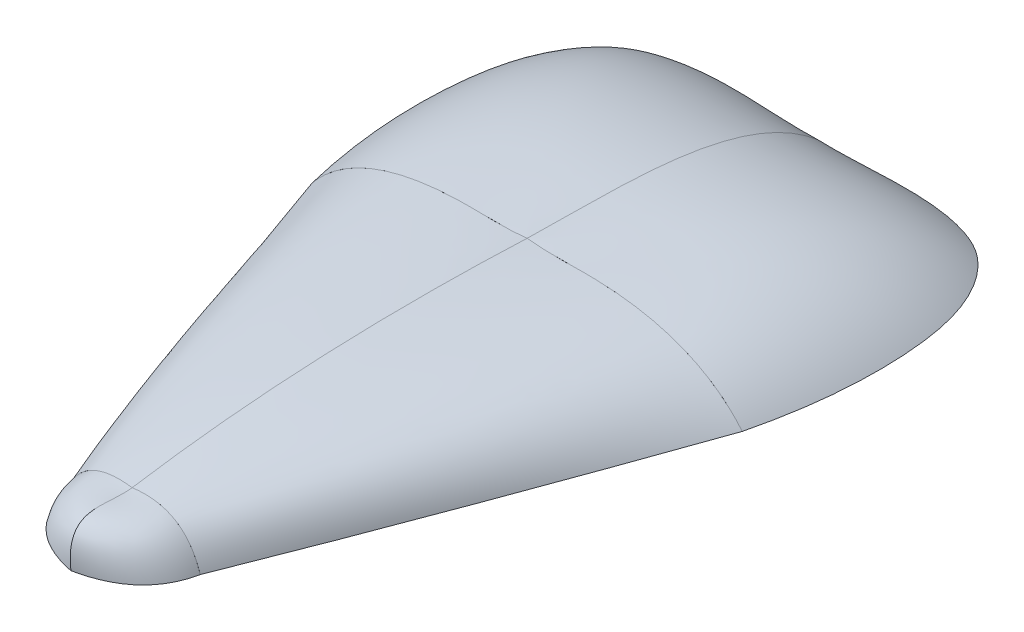
ISO-10303-21;
HEADER;
FILE_DESCRIPTION(('STEP AP214'),'2;1');
FILE_NAME('part.step','',(''),(''),'','','');
FILE_SCHEMA(('AUTOMOTIVE_DESIGN { 1 0 10303 214 1 1 1 1 }'));
ENDSEC;
DATA;
#1=APPLICATION_CONTEXT('core data for automotive mechanical design processes');
#2=APPLICATION_PROTOCOL_DEFINITION('international standard','automotive_design',2000,#1);
#3=PRODUCT_CONTEXT('',#1,'mechanical');
#4=PRODUCT('Part','Part','',(#3));
#5=PRODUCT_RELATED_PRODUCT_CATEGORY('part','',(#4));
#6=PRODUCT_DEFINITION_FORMATION('','',#4);
#7=PRODUCT_DEFINITION_CONTEXT('part definition',#1,'design');
#8=PRODUCT_DEFINITION('design','',#6,#7);
#9=PRODUCT_DEFINITION_SHAPE('','',#8);
#10=(LENGTH_UNIT() NAMED_UNIT(*) SI_UNIT(.MILLI.,.METRE.));
#11=(NAMED_UNIT(*) PLANE_ANGLE_UNIT() SI_UNIT($,.RADIAN.));
#12=(NAMED_UNIT(*) SI_UNIT($,.STERADIAN.) SOLID_ANGLE_UNIT());
#13=UNCERTAINTY_MEASURE_WITH_UNIT(LENGTH_MEASURE(1.E-05),#10,'distance_accuracy_value','');
#14=(GEOMETRIC_REPRESENTATION_CONTEXT(3) GLOBAL_UNCERTAINTY_ASSIGNED_CONTEXT((#13)) GLOBAL_UNIT_ASSIGNED_CONTEXT((#10,
#11,#12)) REPRESENTATION_CONTEXT('',''));
#15=CARTESIAN_POINT('',(0.,0.,0.));
#16=DIRECTION('',(0.,0.,1.));
#17=DIRECTION('',(1.,0.,0.));
#18=AXIS2_PLACEMENT_3D('',#15,#16,#17);
#19=CARTESIAN_POINT('',(0.,-3.048,-2.5));
#20=DIRECTION('',(0.,1.,0.));
#21=DIRECTION('',(0.,0.,1.));
#22=AXIS2_PLACEMENT_3D('',#19,#20,#21);
#23=CYLINDRICAL_SURFACE('',#22,1.50309515720072);
#24=CARTESIAN_POINT('',(0.,-3.048,-2.5));
#25=DIRECTION('',(0.,1.,0.));
#26=DIRECTION('',(0.,0.,1.));
#27=AXIS2_PLACEMENT_3D('',#24,#25,#26);
#28=CIRCLE('',#27,1.50309515720072);
#29=CARTESIAN_POINT('',(0.,-3.048,-0.996904842799275));
#30=VERTEX_POINT('',#29);
#31=EDGE_CURVE('E13',#30,#30,#28,.T.);
#32=ORIENTED_EDGE('',*,*,#31,.T.);
#33=EDGE_LOOP('',(#32));
#34=FACE_BOUND('',#33,.T.);
#35=CARTESIAN_POINT('',(0.,0.253999999999999,-2.5));
#36=DIRECTION('',(0.,1.,0.));
#37=DIRECTION('',(0.,0.,1.));
#38=AXIS2_PLACEMENT_3D('',#35,#36,#37);
#39=CIRCLE('',#38,1.50309515720072);
#40=CARTESIAN_POINT('',(0.,0.253999999999999,-0.996904842799275));
#41=VERTEX_POINT('',#40);
#42=EDGE_CURVE('E93',#41,#41,#39,.T.);
#43=ORIENTED_EDGE('',*,*,#42,.F.);
#44=EDGE_LOOP('',(#43));
#45=FACE_BOUND('',#44,.T.);
#46=ADVANCED_FACE('F87',(#34,#45),#23,.T.);
#47=CARTESIAN_POINT('',(0.,-3.048,-2.5));
#48=DIRECTION('',(0.,1.,0.));
#49=DIRECTION('',(0.,0.,1.));
#50=AXIS2_PLACEMENT_3D('',#47,#48,#49);
#51=PLANE('',#50);
#52=ORIENTED_EDGE('',*,*,#31,.F.);
#53=EDGE_LOOP('',(#52));
#54=FACE_BOUND('',#53,.T.);
#55=ADVANCED_FACE('F102',(#54),#51,.F.);
#56=CARTESIAN_POINT('',(0.,0.253999999999999,-2.5));
#57=DIRECTION('',(0.,1.,0.));
#58=DIRECTION('',(0.,0.,1.));
#59=AXIS2_PLACEMENT_3D('',#56,#57,#58);
#60=PLANE('',#59);
#61=ORIENTED_EDGE('',*,*,#42,.T.);
#62=EDGE_LOOP('',(#61));
#63=FACE_BOUND('',#62,.T.);
#64=ADVANCED_FACE('F99',(#63),#60,.T.);
#65=CLOSED_SHELL('',(#46,#55,#64));
#66=MANIFOLD_SOLID_BREP('B2',#65);
#67=CARTESIAN_POINT('',(-2.5,0.,11.999999954));
#68=CARTESIAN_POINT('',(-2.2485749813273,0.,13.2125933350633));
#69=CARTESIAN_POINT('',(-1.41524164799396,0.,13.9629908761228));
#70=CARTESIAN_POINT('',(0.,0.,14.2511925771786));
#71=CARTESIAN_POINT('',(-2.40547884853265,0.295573915839917,11.999999954));
#72=CARTESIAN_POINT('',(-2.13706852079401,0.372812403053674,13.1924822990457));
#73=CARTESIAN_POINT('',(-1.3352422379498,0.450050890267431,13.961285124088));
#74=CARTESIAN_POINT('',(0.,0.527289377481187,14.306408429127));
#75=CARTESIAN_POINT('',(-2.15953045466497,0.802032900927076,11.999999954));
#76=CARTESIAN_POINT('',(-1.87611820577212,0.943482467398371,13.0805249824838));
#77=CARTESIAN_POINT('',(-1.1562747208838,1.08493203386967,13.8144031309648));
#78=CARTESIAN_POINT('',(0.,1.22638160034096,14.2016343994431));
#79=CARTESIAN_POINT('',(-1.61988959106445,1.30765483877979,11.999999954));
#80=CARTESIAN_POINT('',(-1.37088055137328,1.39082830464443,12.7677318602908));
#81=CARTESIAN_POINT('',(-0.8309173543518,1.47400177050907,13.3043658465798));
#82=CARTESIAN_POINT('',(0.,1.55717523637372,13.609901912867));
#83=CARTESIAN_POINT('',(-0.909530454664967,1.55921023685447,11.999999954));
#84=CARTESIAN_POINT('',(-0.751830715108469,1.54571984863648,12.3804301769782));
#85=CARTESIAN_POINT('',(-0.448653896886813,1.53222946041848,12.6453114399556));
#86=CARTESIAN_POINT('',(0.,1.51873907220048,12.794643742932));
#87=CARTESIAN_POINT('',(-0.322145515199319,1.55753614238557,11.999999954));
#88=CARTESIAN_POINT('',(-0.263256036354599,1.53148132647314,12.1194557381771));
#89=CARTESIAN_POINT('',(-0.155874197954826,1.5054265105607,12.2003952023538));
#90=CARTESIAN_POINT('',(0.,1.47937169464826,12.2428183465302));
#91=CARTESIAN_POINT('',(0.,1.51435467185479,11.999999954));
#92=CARTESIAN_POINT('',(0.,1.51435467185479,11.999999954));
#93=CARTESIAN_POINT('',(0.,1.51435467185479,11.999999954));
#94=CARTESIAN_POINT('',(0.,1.51435467185479,11.999999954));
#95=B_SPLINE_SURFACE_WITH_KNOTS('',3,3,((#67,#68,#69,#70),(#71,#72,#73,#74),(#75,#76,#77,#78),
(#79,#80,#81,#82),(#83,#84,#85,#86),(#87,#88,#89,#90),(#91,#92,#93,#94)),.UNSPECIFIED.,.F.,.F.,
.F.,(4,1,1,1,4),(4,4),(0.,0.25,0.5,0.75,1.),(0.,1.),.UNSPECIFIED.);
#96=CARTESIAN_POINT('',(-2.5,0.,11.999999954));
#97=CARTESIAN_POINT('',(-2.40547884853265,0.295573915839917,11.999999954));
#98=CARTESIAN_POINT('',(-2.15953045466497,0.802032900927076,11.999999954));
#99=CARTESIAN_POINT('',(-1.61988959106445,1.30765483877979,11.999999954));
#100=CARTESIAN_POINT('',(-0.909530454664967,1.55921023685447,11.999999954));
#101=CARTESIAN_POINT('',(-0.322145515199319,1.55753614238557,11.999999954));
#102=CARTESIAN_POINT('',(0.,1.51435467185479,11.999999954));
#103=B_SPLINE_CURVE_WITH_KNOTS('',3,(#96,#97,#98,#99,#100,#101,#102),.UNSPECIFIED.,.F.,.F.,(4,1,
1,1,4),(0.,0.25,0.5,0.75,1.),.UNSPECIFIED.);
#104=CARTESIAN_POINT('',(-2.5,0.,11.999999954));
#105=VERTEX_POINT('',#104);
#106=CARTESIAN_POINT('',(0.,1.51435467185479,11.999999954));
#107=VERTEX_POINT('',#106);
#108=EDGE_CURVE('E85',#105,#107,#103,.T.);
#109=CARTESIAN_POINT('',(-2.5,0.,11.999999954));
#110=CARTESIAN_POINT('',(-2.2485749813273,0.,13.2125933350633));
#111=CARTESIAN_POINT('',(-1.41524164799396,0.,13.9629908761228));
#112=CARTESIAN_POINT('',(0.,0.,14.2511925771786));
#113=B_SPLINE_CURVE_WITH_KNOTS('',3,(#109,#110,#111,#112),.UNSPECIFIED.,.F.,.F.,(4,4),(0.,1.),.UNSPECIFIED.);
#114=CARTESIAN_POINT('',(0.,0.,14.2511925771786));
#115=VERTEX_POINT('',#114);
#116=EDGE_CURVE('E140',#115,#105,#113,.F.);
#117=CARTESIAN_POINT('',(0.,0.,14.2511925771786));
#118=CARTESIAN_POINT('',(0.,0.527289377481187,14.306408429127));
#119=CARTESIAN_POINT('',(0.,1.22638160034096,14.2016343994431));
#120=CARTESIAN_POINT('',(0.,1.55717523637372,13.609901912867));
#121=CARTESIAN_POINT('',(0.,1.51873907220048,12.794643742932));
#122=CARTESIAN_POINT('',(0.,1.47937169464826,12.2428183465302));
#123=CARTESIAN_POINT('',(0.,1.51435467185479,11.999999954));
#124=B_SPLINE_CURVE_WITH_KNOTS('',3,(#117,#118,#119,#120,#121,#122,#123),.UNSPECIFIED.,.F.,.F.,
(4,1,1,1,4),(0.,0.25,0.5,0.75,1.),.UNSPECIFIED.);
#125=EDGE_CURVE('E147',#107,#115,#124,.F.);
#126=ORIENTED_EDGE('',*,*,#108,.F.);
#127=ORIENTED_EDGE('',*,*,#116,.F.);
#128=ORIENTED_EDGE('',*,*,#125,.F.);
#129=EDGE_LOOP('',(#126,#127,#128));
#130=FACE_BOUND('',#129,.T.);
#131=ADVANCED_FACE('F137',(#130),#95,.F.);
#132=OPEN_SHELL('',(#131));
#133=SHELL_BASED_SURFACE_MODEL('B8',(#132));
#134=CARTESIAN_POINT('',(-7.89646434519079,0.,-2.5));
#135=CARTESIAN_POINT('',(-8.34056381802185,0.,-4.3145718992722));
#136=CARTESIAN_POINT('',(-8.67675271254389,0.,-7.22662606235981));
#137=CARTESIAN_POINT('',(-8.04620599111287,0.,-10.7905165297115));
#138=CARTESIAN_POINT('',(-6.68608144682956,0.,-12.5381744419552));
#139=CARTESIAN_POINT('',(-3.9824740090126,0.,-13.5236682374836));
#140=CARTESIAN_POINT('',(-1.72189430537076,0.,-13.0985066910037));
#141=CARTESIAN_POINT('',(0.,0.,-13.1616084390565));
#142=CARTESIAN_POINT('',(-7.43335469209301,0.562300337042816,-2.5));
#143=CARTESIAN_POINT('',(-7.81930023009668,0.56717082817761,-4.18245510758736));
#144=CARTESIAN_POINT('',(-8.09443307157859,0.574781026051725,-6.88167820365306));
#145=CARTESIAN_POINT('',(-7.47639444109343,0.584002884015909,-10.1847373428587));
#146=CARTESIAN_POINT('',(-6.20567008023899,0.58951781351622,-11.8083815164927));
#147=CARTESIAN_POINT('',(-3.69542722662514,0.59687366268603,-12.7405936234004));
#148=CARTESIAN_POINT('',(-1.59829028668191,0.602617851765771,-12.3733855692359));
#149=CARTESIAN_POINT('',(0.,0.607198478174591,-12.4491897918613));
#150=CARTESIAN_POINT('',(-6.31019405332889,1.41496266989754,-2.5));
#151=CARTESIAN_POINT('',(-6.60119565769317,1.42168322706584,-3.89633573615478));
#152=CARTESIAN_POINT('',(-6.78759778645896,1.43218417418997,-6.13569990504435));
#153=CARTESIAN_POINT('',(-6.2350261215827,1.44490897379045,-8.87565752206856));
#154=CARTESIAN_POINT('',(-5.16729282986084,1.45251876055737,-10.2264926153789));
#155=CARTESIAN_POINT('',(-3.07604486214526,1.4626687441009,-11.0190874801478));
#156=CARTESIAN_POINT('',(-1.33098977673827,1.47059487516808,-10.7419746184739));
#157=CARTESIAN_POINT('',(0.,1.47691546190053,-10.8226005233819));
#158=CARTESIAN_POINT('',(-4.60159741079324,1.94243165659006,-2.5));
#159=CARTESIAN_POINT('',(-4.80696667748336,1.94332346827715,-3.50710396689867));
#160=CARTESIAN_POINT('',(-4.93409263454699,1.94471693419616,-5.12229637495215));
#161=CARTESIAN_POINT('',(-4.5259274387756,1.94640550327093,-7.09857822544378));
#162=CARTESIAN_POINT('',(-3.74935324877032,1.9474153148989,-8.0726405719618));
#163=CARTESIAN_POINT('',(-2.23176028392809,1.94876220827711,-8.64301509880276));
#164=CARTESIAN_POINT('',(-0.965783369291165,1.94981399849957,-8.44127320442748));
#165=CARTESIAN_POINT('',(0.,1.95065273448174,-8.49822327642134));
#166=CARTESIAN_POINT('',(-3.17543750348962,2.12287676141758,-2.5));
#167=CARTESIAN_POINT('',(-3.31873179757238,2.12154193141696,-3.19064816762963));
#168=CARTESIAN_POINT('',(-3.40848516791736,2.11945624433698,-4.29858063447368));
#169=CARTESIAN_POINT('',(-3.12802150130888,2.1169288580157,-5.65432153400632));
#170=CARTESIAN_POINT('',(-2.59165639353247,2.11541741016689,-6.32122441208183));
#171=CARTESIAN_POINT('',(-1.54269994477087,2.11340143110439,-6.70616492362092));
#172=CARTESIAN_POINT('',(-0.667570077295998,2.11182715128318,-6.55873986331736));
#173=CARTESIAN_POINT('',(0.,2.11057176299011,-6.59198064635268));
#174=CARTESIAN_POINT('',(-2.10159948416586,2.15700841213018,-2.5));
#175=CARTESIAN_POINT('',(-2.19879512150797,2.15713976610513,-2.95424091352454));
#176=CARTESIAN_POINT('',(-2.2612340143928,2.15734500818715,-3.68318874033598));
#177=CARTESIAN_POINT('',(-2.07741286941587,2.15759371569251,-4.57529350292058));
#178=CARTESIAN_POINT('',(-1.7217226896969,2.15774244975062,-5.01288503586581));
#179=CARTESIAN_POINT('',(-1.02493469503228,2.15794083221367,-5.26016154499705));
#180=CARTESIAN_POINT('',(-0.443479767784941,2.15809574925338,-5.1545763589191));
#181=CARTESIAN_POINT('',(0.,2.15821928576539,-5.17091414863022));
#182=CARTESIAN_POINT('',(-1.05094355868215,2.12459708971799,-2.5));
#183=CARTESIAN_POINT('',(-1.0995257763182,2.12961114970318,-2.7222380420449));
#184=CARTESIAN_POINT('',(-1.13072084596572,2.13744567554132,-3.07908312684293));
#185=CARTESIAN_POINT('',(-1.03878073425319,2.14693936883171,-3.51589107388831));
#186=CARTESIAN_POINT('',(-0.860917979109895,2.15261686347514,-3.72915840961086));
#187=CARTESIAN_POINT('',(-0.512500419706074,2.16018954309998,-3.84542280695111));
#188=CARTESIAN_POINT('',(-0.22175455644006,2.16610305527257,-3.78687196232598));
#189=CARTESIAN_POINT('',(0.,2.17081870610694,-3.79044901681592));
#190=CARTESIAN_POINT('',(-0.351249295195281,2.14911929975866,-2.5));
#191=CARTESIAN_POINT('',(-0.367341964512647,2.15254318153421,-2.5728189076613));
#192=CARTESIAN_POINT('',(-0.377581877363093,2.15789303580731,-2.68979781789301));
#193=CARTESIAN_POINT('',(-0.346743175128629,2.16437586280494,-2.83301393227657));
#194=CARTESIAN_POINT('',(-0.287340769698699,2.16825277502734,-2.90267582959303));
#195=CARTESIAN_POINT('',(-0.171048435051299,2.17342382599925,-2.93952700051606));
#196=CARTESIAN_POINT('',(-0.074013553748061,2.17746190424664,-2.91852350738123));
#197=CARTESIAN_POINT('',(0.,2.18068201549368,-2.91853043359792));
#198=CARTESIAN_POINT('',(0.,2.19218686850553,-2.5));
#199=CARTESIAN_POINT('',(0.,2.19218686850553,-2.5));
#200=CARTESIAN_POINT('',(0.,2.19218686850553,-2.5));
#201=CARTESIAN_POINT('',(0.,2.19218686850553,-2.5));
#202=CARTESIAN_POINT('',(0.,2.19218686850553,-2.5));
#203=CARTESIAN_POINT('',(0.,2.19218686850553,-2.5));
#204=CARTESIAN_POINT('',(0.,2.19218686850553,-2.5));
#205=CARTESIAN_POINT('',(0.,2.19218686850553,-2.5));
#206=B_SPLINE_SURFACE_WITH_KNOTS('',3,3,((#134,#135,#136,#137,#138,#139,#140,#141),(#142,#143,
#144,#145,#146,#147,#148,#149),(#150,#151,#152,#153,#154,#155,#156,#157),(#158,#159,#160,#161,
#162,#163,#164,#165),(#166,#167,#168,#169,#170,#171,#172,#173),(#174,#175,#176,#177,#178,#179,
#180,#181),(#182,#183,#184,#185,#186,#187,#188,#189),(#190,#191,#192,#193,#194,#195,#196,#197),
(#198,#199,#200,#201,#202,#203,#204,#205)),.UNSPECIFIED.,.F.,.F.,.F.,(4,1,1,1,1,1,4),(4,1,1,1,1,
4),(0.,0.25,0.5,0.625,0.75,0.875,1.),(0.,0.325436043365303,0.508497524548682,0.616185285073449,
0.693932112108406,1.),.UNSPECIFIED.);
#207=CARTESIAN_POINT('',(-7.89646434519079,0.,-2.5));
#208=CARTESIAN_POINT('',(-7.43335469209301,0.562300337042816,-2.5));
#209=CARTESIAN_POINT('',(-6.31019405332889,1.41496266989754,-2.5));
#210=CARTESIAN_POINT('',(-4.60159741079324,1.94243165659006,-2.5));
#211=CARTESIAN_POINT('',(-3.17543750348962,2.12287676141758,-2.5));
#212=CARTESIAN_POINT('',(-2.10159948416586,2.15700841213018,-2.5));
#213=CARTESIAN_POINT('',(-1.05094355868215,2.12459708971799,-2.5));
#214=CARTESIAN_POINT('',(-0.351249295195281,2.14911929975866,-2.5));
#215=CARTESIAN_POINT('',(0.,2.19218686850553,-2.5));
#216=B_SPLINE_CURVE_WITH_KNOTS('',3,(#207,#208,#209,#210,#211,#212,#213,#214,#215),
.UNSPECIFIED.,.F.,.F.,(4,1,1,1,1,1,4),(0.,0.25,0.5,0.625,0.75,0.875,1.),.UNSPECIFIED.);
#217=CARTESIAN_POINT('',(-7.89646434519079,0.,-2.5));
#218=VERTEX_POINT('',#217);
#219=CARTESIAN_POINT('',(0.,2.19218686850553,-2.5));
#220=VERTEX_POINT('',#219);
#221=EDGE_CURVE('E135',#218,#220,#216,.T.);
#222=CARTESIAN_POINT('',(-7.89646434519079,0.,-2.5));
#223=CARTESIAN_POINT('',(-8.34056381802185,0.,-4.3145718992722));
#224=CARTESIAN_POINT('',(-8.67675271254389,0.,-7.22662606235981));
#225=CARTESIAN_POINT('',(-8.04620599111287,0.,-10.7905165297115));
#226=CARTESIAN_POINT('',(-6.68608144682956,0.,-12.5381744419552));
#227=CARTESIAN_POINT('',(-3.9824740090126,0.,-13.5236682374836));
#228=CARTESIAN_POINT('',(-1.72189430537076,0.,-13.0985066910037));
#229=CARTESIAN_POINT('',(0.,0.,-13.1616084390565));
#230=B_SPLINE_CURVE_WITH_KNOTS('',3,(#222,#223,#224,#225,#226,#227,#228,#229),.UNSPECIFIED.,.F.,
.F.,(4,1,1,1,1,4),(0.,0.325436043365303,0.508497524548682,0.616185285073449,0.693932112108406,
1.),.UNSPECIFIED.);
#231=CARTESIAN_POINT('',(0.,0.,-13.1616084390565));
#232=VERTEX_POINT('',#231);
#233=EDGE_CURVE('E207',#232,#218,#230,.F.);
#234=CARTESIAN_POINT('',(0.,0.,-13.1616084390565));
#235=CARTESIAN_POINT('',(0.,0.607198478174591,-12.4491897918613));
#236=CARTESIAN_POINT('',(0.,1.47691546190053,-10.8226005233819));
#237=CARTESIAN_POINT('',(0.,1.95065273448174,-8.49822327642134));
#238=CARTESIAN_POINT('',(0.,2.11057176299011,-6.59198064635268));
#239=CARTESIAN_POINT('',(0.,2.15821928576539,-5.17091414863022));
#240=CARTESIAN_POINT('',(0.,2.17081870610694,-3.79044901681592));
#241=CARTESIAN_POINT('',(0.,2.18068201549368,-2.91853043359792));
#242=CARTESIAN_POINT('',(0.,2.19218686850553,-2.5));
#243=B_SPLINE_CURVE_WITH_KNOTS('',3,(#234,#235,#236,#237,#238,#239,#240,#241,#242),
.UNSPECIFIED.,.F.,.F.,(4,1,1,1,1,1,4),(0.,0.25,0.5,0.625,0.75,0.875,1.),.UNSPECIFIED.);
#244=EDGE_CURVE('E214',#220,#232,#243,.F.);
#245=ORIENTED_EDGE('',*,*,#221,.F.);
#246=ORIENTED_EDGE('',*,*,#233,.F.);
#247=ORIENTED_EDGE('',*,*,#244,.F.);
#248=EDGE_LOOP('',(#245,#246,#247));
#249=FACE_BOUND('',#248,.T.);
#250=ADVANCED_FACE('F204',(#249),#206,.F.);
#251=OPEN_SHELL('',(#250));
#252=SHELL_BASED_SURFACE_MODEL('B79',(#251));
#253=CARTESIAN_POINT('',(0.,1.51435467185479,11.999999954));
#254=CARTESIAN_POINT('',(0.,1.85660478838936,9.83895935303896));
#255=CARTESIAN_POINT('',(0.,2.32574567800001,5.01683425912099));
#256=CARTESIAN_POINT('',(0.,2.30849291948985,0.172292717038958));
#257=CARTESIAN_POINT('',(0.,2.19218686850553,-2.5));
#258=CARTESIAN_POINT('',(-0.16107275759966,1.53594540712018,11.999999954));
#259=CARTESIAN_POINT('',(-0.181111002551063,1.86460403514473,9.8383074416645));
#260=CARTESIAN_POINT('',(-0.214060342070815,2.30721618291837,5.01749964462922));
#261=CARTESIAN_POINT('',(-0.306804435010172,2.2654112415633,0.171640805664504));
#262=CARTESIAN_POINT('',(-0.351249295195281,2.14911929975866,-2.5));
#263=CARTESIAN_POINT('',(-0.468991750065731,1.5579546660028,11.999999954));
#264=CARTESIAN_POINT('',(-0.52910648491994,1.85943031700729,9.8370036189156));
#265=CARTESIAN_POINT('',(-0.705625926588749,2.26729290298363,5.01883041564569));
#266=CARTESIAN_POINT('',(-0.917489171442984,2.24091081555632,0.170336982915602));
#267=CARTESIAN_POINT('',(-1.05082375199831,2.12464709211102,-2.5));
#268=CARTESIAN_POINT('',(-0.888190670565093,1.52745191938222,11.999999954));
#269=CARTESIAN_POINT('',(-1.08101565809554,1.8059291023646,9.83742413063987));
#270=CARTESIAN_POINT('',(-1.49374918239307,2.20172799856359,5.01840121250807));
#271=CARTESIAN_POINT('',(-1.89001206458471,2.22463375443513,0.170757494639875));
#272=CARTESIAN_POINT('',(-2.10182779442038,2.1569133989757,-2.5));
#273=CARTESIAN_POINT('',(-1.26471002286471,1.43343253781713,11.999999954));
#274=CARTESIAN_POINT('',(-1.61140157494126,1.70498766994126,9.84092439587138));
#275=CARTESIAN_POINT('',(-2.30964319962921,2.10432272120786,5.01482860148871));
#276=CARTESIAN_POINT('',(-2.88486935521226,2.16477354072991,0.174257759871373));
#277=CARTESIAN_POINT('',(-3.1750836646371,2.12302165976467,-2.5));
#278=CARTESIAN_POINT('',(-1.70982973499787,1.22338451580433,11.999999954));
#279=CARTESIAN_POINT('',(-2.27017801244152,1.489534582103,9.8486830241705));
#280=CARTESIAN_POINT('',(-3.37240165185119,1.89501272902799,5.00690961274836));
#281=CARTESIAN_POINT('',(-4.19929290221076,1.96961794538549,0.182016388170507));
#282=CARTESIAN_POINT('',(-4.60233754641636,1.94214510274527,-2.5));
#283=CARTESIAN_POINT('',(-2.15953045466497,0.802032900927076,11.999999954));
#284=CARTESIAN_POINT('',(-2.97545699739219,1.0519525354009,9.86354905057317));
#285=CARTESIAN_POINT('',(-4.53372965638307,1.38456863937364,4.99173632551804));
#286=CARTESIAN_POINT('',(-5.7357441605588,1.45230337871016,0.196882414573182));
#287=CARTESIAN_POINT('',(-6.30958205170372,1.41528770891333,-2.5));
#288=CARTESIAN_POINT('',(-2.40547884853265,0.295573915839917,11.999999954));
#289=CARTESIAN_POINT('',(-3.24879961405326,0.378880460664525,9.84928166899819));
#290=CARTESIAN_POINT('',(-5.11712685690722,0.584507361363791,5.006298594735));
#291=CARTESIAN_POINT('',(-6.61420634739162,0.574638893641762,0.182615032998192));
#292=CARTESIAN_POINT('',(-7.43335469209301,0.562300337042816,-2.5));
#293=CARTESIAN_POINT('',(-2.5,0.,11.999999954));
#294=CARTESIAN_POINT('',(-3.3570178769173,0.,9.8421479782107));
#295=CARTESIAN_POINT('',(-5.2085534442041,0.,5.01357972934348));
#296=CARTESIAN_POINT('',(-6.95466077371116,0.,0.175481342210698));
#297=CARTESIAN_POINT('',(-7.89646434519079,0.,-2.5));
#298=B_SPLINE_SURFACE_WITH_KNOTS('',3,3,((#253,#254,#255,#256,#257),(#258,#259,#260,#261,#262),
(#263,#264,#265,#266,#267),(#268,#269,#270,#271,#272),(#273,#274,#275,#276,#277),(#278,#279,
#280,#281,#282),(#283,#284,#285,#286,#287),(#288,#289,#290,#291,#292),(#293,#294,#295,#296,
#297)),.UNSPECIFIED.,.F.,.F.,.F.,(4,1,1,1,1,1,4),(4,1,4),(0.,0.125,0.25,0.375,0.5,0.75,1.),(0.,
0.44943167136318,1.),.UNSPECIFIED.);
#299=CARTESIAN_POINT('',(0.,1.51435467185479,11.999999954));
#300=CARTESIAN_POINT('',(-0.16107275759966,1.53594540712018,11.999999954));
#301=CARTESIAN_POINT('',(-0.468991750065731,1.5579546660028,11.999999954));
#302=CARTESIAN_POINT('',(-0.888190670565093,1.52745191938222,11.999999954));
#303=CARTESIAN_POINT('',(-1.26471002286471,1.43343253781713,11.999999954));
#304=CARTESIAN_POINT('',(-1.70982973499787,1.22338451580433,11.999999954));
#305=CARTESIAN_POINT('',(-2.15953045466497,0.802032900927076,11.999999954));
#306=CARTESIAN_POINT('',(-2.40547884853265,0.295573915839917,11.999999954));
#307=CARTESIAN_POINT('',(-2.5,0.,11.999999954));
#308=B_SPLINE_CURVE_WITH_KNOTS('',3,(#299,#300,#301,#302,#303,#304,#305,#306,#307),
.UNSPECIFIED.,.F.,.F.,(4,1,1,1,1,1,4),(0.,0.125,0.25,0.375,0.5,0.75,1.),.UNSPECIFIED.);
#309=CARTESIAN_POINT('',(0.,1.51435467185479,11.999999954));
#310=VERTEX_POINT('',#309);
#311=CARTESIAN_POINT('',(-2.5,0.,11.999999954));
#312=VERTEX_POINT('',#311);
#313=EDGE_CURVE('E313',#310,#312,#308,.T.);
#314=CARTESIAN_POINT('',(0.,1.51435467185479,11.999999954));
#315=CARTESIAN_POINT('',(0.,1.85660478838936,9.83895935303896));
#316=CARTESIAN_POINT('',(0.,2.32574567800001,5.01683425912099));
#317=CARTESIAN_POINT('',(0.,2.30849291948985,0.172292717038958));
#318=CARTESIAN_POINT('',(0.,2.19218686850553,-2.5));
#319=B_SPLINE_CURVE_WITH_KNOTS('',3,(#314,#315,#316,#317,#318),.UNSPECIFIED.,.F.,.F.,(4,1,4),
(0.,0.44943167136318,1.),.UNSPECIFIED.);
#320=CARTESIAN_POINT('',(0.,2.19218686850553,-2.5));
#321=VERTEX_POINT('',#320);
#322=EDGE_CURVE('E339',#321,#310,#319,.F.);
#323=CARTESIAN_POINT('',(0.,2.19218686850553,-2.5));
#324=CARTESIAN_POINT('',(-0.351249295195281,2.14911929975866,-2.5));
#325=CARTESIAN_POINT('',(-1.05082375199831,2.12464709211102,-2.5));
#326=CARTESIAN_POINT('',(-2.10182779442038,2.1569133989757,-2.5));
#327=CARTESIAN_POINT('',(-3.1750836646371,2.12302165976467,-2.5));
#328=CARTESIAN_POINT('',(-4.60233754641636,1.94214510274527,-2.5));
#329=CARTESIAN_POINT('',(-6.30958205170372,1.41528770891333,-2.5));
#330=CARTESIAN_POINT('',(-7.43335469209301,0.562300337042816,-2.5));
#331=CARTESIAN_POINT('',(-7.89646434519079,0.,-2.5));
#332=B_SPLINE_CURVE_WITH_KNOTS('',3,(#323,#324,#325,#326,#327,#328,#329,#330,#331),
.UNSPECIFIED.,.F.,.F.,(4,1,1,1,1,1,4),(0.,0.125,0.25,0.375,0.5,0.75,1.),.UNSPECIFIED.);
#333=CARTESIAN_POINT('',(-7.89646434519079,0.,-2.5));
#334=VERTEX_POINT('',#333);
#335=EDGE_CURVE('E315',#334,#321,#332,.F.);
#336=CARTESIAN_POINT('',(-2.5,0.,11.999999954));
#337=CARTESIAN_POINT('',(-3.3570178769173,0.,9.8421479782107));
#338=CARTESIAN_POINT('',(-5.2085534442041,0.,5.01357972934348));
#339=CARTESIAN_POINT('',(-6.95466077371116,0.,0.175481342210698));
#340=CARTESIAN_POINT('',(-7.89646434519079,0.,-2.5));
#341=B_SPLINE_CURVE_WITH_KNOTS('',3,(#336,#337,#338,#339,#340),.UNSPECIFIED.,.F.,.F.,(4,1,4),
(0.,0.44943167136318,1.),.UNSPECIFIED.);
#342=EDGE_CURVE('E304',#312,#334,#341,.T.);
#343=ORIENTED_EDGE('',*,*,#313,.F.);
#344=ORIENTED_EDGE('',*,*,#322,.F.);
#345=ORIENTED_EDGE('',*,*,#335,.F.);
#346=ORIENTED_EDGE('',*,*,#342,.F.);
#347=EDGE_LOOP('',(#343,#344,#345,#346));
#348=FACE_BOUND('',#347,.T.);
#349=ADVANCED_FACE('F271',(#348),#298,.F.);
#350=CARTESIAN_POINT('',(-2.5,0.,11.999999954));
#351=DIRECTION('',(0.,-1.,0.));
#352=DIRECTION('',(1.,0.,0.));
#353=AXIS2_PLACEMENT_3D('',#350,#351,#352);
#354=PLANE('',#353);
#355=DIRECTION('',(1.,0.,0.));
#356=VECTOR('',#355,1.);
#357=CARTESIAN_POINT('',(-1.25,0.,11.999999954));
#358=LINE('',#357,#356);
#359=CARTESIAN_POINT('',(0.,0.,11.999999954));
#360=VERTEX_POINT('',#359);
#361=EDGE_CURVE('E300',#312,#360,#358,.T.);
#362=ORIENTED_EDGE('',*,*,#361,.F.);
#363=ORIENTED_EDGE('',*,*,#342,.T.);
#364=DIRECTION('',(-1.,0.,0.));
#365=VECTOR('',#364,1.);
#366=CARTESIAN_POINT('',(-3.9482321725954,0.,-2.5));
#367=LINE('',#366,#365);
#368=CARTESIAN_POINT('',(0.,0.,-2.5));
#369=VERTEX_POINT('',#368);
#370=EDGE_CURVE('E318',#369,#334,#367,.T.);
#371=ORIENTED_EDGE('',*,*,#370,.F.);
#372=DIRECTION('',(0.,0.,-1.));
#373=VECTOR('',#372,1.);
#374=CARTESIAN_POINT('',(0.,0.,4.76677514468691));
#375=LINE('',#374,#373);
#376=EDGE_CURVE('E306',#360,#369,#375,.T.);
#377=ORIENTED_EDGE('',*,*,#376,.F.);
#378=EDGE_LOOP('',(#362,#363,#371,#377));
#379=FACE_BOUND('',#378,.T.);
#380=ADVANCED_FACE('F302',(#379),#354,.T.);
#381=CARTESIAN_POINT('',(0.,0.,11.999999954));
#382=DIRECTION('',(1.,0.,0.));
#383=DIRECTION('',(0.,1.,0.));
#384=AXIS2_PLACEMENT_3D('',#381,#382,#383);
#385=PLANE('',#384);
#386=DIRECTION('',(0.,1.,0.));
#387=VECTOR('',#386,1.);
#388=CARTESIAN_POINT('',(0.,0.757177335927395,11.999999954));
#389=LINE('',#388,#387);
#390=EDGE_CURVE('E202',#360,#310,#389,.T.);
#391=ORIENTED_EDGE('',*,*,#390,.F.);
#392=ORIENTED_EDGE('',*,*,#376,.T.);
#393=DIRECTION('',(0.,-1.,0.));
#394=VECTOR('',#393,1.);
#395=CARTESIAN_POINT('',(0.,1.09609343425277,-2.5));
#396=LINE('',#395,#394);
#397=EDGE_CURVE('E274',#321,#369,#396,.T.);
#398=ORIENTED_EDGE('',*,*,#397,.F.);
#399=ORIENTED_EDGE('',*,*,#322,.T.);
#400=EDGE_LOOP('',(#391,#392,#398,#399));
#401=FACE_BOUND('',#400,.T.);
#402=ADVANCED_FACE('F272',(#401),#385,.T.);
#403=OPEN_SHELL('',(#349,#380,#402));
#404=SHELL_BASED_SURFACE_MODEL('B129',(#403));
#405=CARTESIAN_POINT('',(2.5,0.,11.999999954));
#406=CARTESIAN_POINT('',(2.2485749813273,0.,13.2125933350633));
#407=CARTESIAN_POINT('',(1.41524164799396,0.,13.9629908761228));
#408=CARTESIAN_POINT('',(0.,0.,14.2511925771786));
#409=CARTESIAN_POINT('',(2.40547884853265,0.295573915839917,11.999999954));
#410=CARTESIAN_POINT('',(2.13706852079401,0.372812403053674,13.1924822990457));
#411=CARTESIAN_POINT('',(1.3352422379498,0.450050890267431,13.961285124088));
#412=CARTESIAN_POINT('',(0.,0.527289377481187,14.306408429127));
#413=CARTESIAN_POINT('',(2.15953045466497,0.802032900927076,11.999999954));
#414=CARTESIAN_POINT('',(1.87611820577212,0.943482467398371,13.0805249824838));
#415=CARTESIAN_POINT('',(1.1562747208838,1.08493203386967,13.8144031309648));
#416=CARTESIAN_POINT('',(0.,1.22638160034096,14.2016343994431));
#417=CARTESIAN_POINT('',(1.61988959106445,1.30765483877979,11.999999954));
#418=CARTESIAN_POINT('',(1.37088055137328,1.39082830464443,12.7677318602908));
#419=CARTESIAN_POINT('',(0.8309173543518,1.47400177050907,13.3043658465798));
#420=CARTESIAN_POINT('',(0.,1.55717523637372,13.609901912867));
#421=CARTESIAN_POINT('',(0.909530454664967,1.55921023685447,11.999999954));
#422=CARTESIAN_POINT('',(0.751830715108469,1.54571984863648,12.3804301769782));
#423=CARTESIAN_POINT('',(0.448653896886813,1.53222946041848,12.6453114399556));
#424=CARTESIAN_POINT('',(0.,1.51873907220048,12.794643742932));
#425=CARTESIAN_POINT('',(0.322145515199319,1.55753614238557,11.999999954));
#426=CARTESIAN_POINT('',(0.263256036354599,1.53148132647314,12.1194557381771));
#427=CARTESIAN_POINT('',(0.155874197954826,1.5054265105607,12.2003952023538));
#428=CARTESIAN_POINT('',(0.,1.47937169464826,12.2428183465302));
#429=CARTESIAN_POINT('',(0.,1.51435467185479,11.999999954));
#430=CARTESIAN_POINT('',(0.,1.51435467185479,11.999999954));
#431=CARTESIAN_POINT('',(0.,1.51435467185479,11.999999954));
#432=CARTESIAN_POINT('',(0.,1.51435467185479,11.999999954));
#433=B_SPLINE_SURFACE_WITH_KNOTS('',3,3,((#405,#406,#407,#408),(#409,#410,#411,#412),(#413,#414,
#415,#416),(#417,#418,#419,#420),(#421,#422,#423,#424),(#425,#426,#427,#428),(#429,#430,#431,
#432)),.UNSPECIFIED.,.F.,.F.,.F.,(4,1,1,1,4),(4,4),(0.,0.25,0.5,0.75,1.),(0.,1.),.UNSPECIFIED.);
#434=CARTESIAN_POINT('',(2.5,0.,11.999999954));
#435=CARTESIAN_POINT('',(2.40547884853265,0.295573915839917,11.999999954));
#436=CARTESIAN_POINT('',(2.15953045466497,0.802032900927076,11.999999954));
#437=CARTESIAN_POINT('',(1.61988959106445,1.30765483877979,11.999999954));
#438=CARTESIAN_POINT('',(0.909530454664967,1.55921023685447,11.999999954));
#439=CARTESIAN_POINT('',(0.322145515199319,1.55753614238557,11.999999954));
#440=CARTESIAN_POINT('',(0.,1.51435467185479,11.999999954));
#441=B_SPLINE_CURVE_WITH_KNOTS('',3,(#434,#435,#436,#437,#438,#439,#440),.UNSPECIFIED.,.F.,.F.,
(4,1,1,1,4),(0.,0.25,0.5,0.75,1.),.UNSPECIFIED.);
#442=CARTESIAN_POINT('',(2.5,0.,11.999999954));
#443=VERTEX_POINT('',#442);
#444=CARTESIAN_POINT('',(0.,1.51435467185479,11.999999954));
#445=VERTEX_POINT('',#444);
#446=EDGE_CURVE('E269',#443,#445,#441,.T.);
#447=CARTESIAN_POINT('',(0.,0.,14.2511925771786));
#448=CARTESIAN_POINT('',(0.,0.527289377481187,14.306408429127));
#449=CARTESIAN_POINT('',(0.,1.22638160034096,14.2016343994431));
#450=CARTESIAN_POINT('',(0.,1.55717523637372,13.609901912867));
#451=CARTESIAN_POINT('',(0.,1.51873907220048,12.794643742932));
#452=CARTESIAN_POINT('',(0.,1.47937169464826,12.2428183465302));
#453=CARTESIAN_POINT('',(0.,1.51435467185479,11.999999954));
#454=B_SPLINE_CURVE_WITH_KNOTS('',3,(#447,#448,#449,#450,#451,#452,#453),.UNSPECIFIED.,.F.,.F.,
(4,1,1,1,4),(0.,0.25,0.5,0.75,1.),.UNSPECIFIED.);
#455=CARTESIAN_POINT('',(0.,0.,14.2511925771786));
#456=VERTEX_POINT('',#455);
#457=EDGE_CURVE('E414',#445,#456,#454,.F.);
#458=CARTESIAN_POINT('',(2.5,0.,11.999999954));
#459=CARTESIAN_POINT('',(2.2485749813273,0.,13.2125933350633));
#460=CARTESIAN_POINT('',(1.41524164799396,0.,13.9629908761228));
#461=CARTESIAN_POINT('',(0.,0.,14.2511925771786));
#462=B_SPLINE_CURVE_WITH_KNOTS('',3,(#458,#459,#460,#461),.UNSPECIFIED.,.F.,.F.,(4,4),(0.,1.),.UNSPECIFIED.);
#463=EDGE_CURVE('E407',#456,#443,#462,.F.);
#464=ORIENTED_EDGE('',*,*,#446,.T.);
#465=ORIENTED_EDGE('',*,*,#457,.T.);
#466=ORIENTED_EDGE('',*,*,#463,.T.);
#467=EDGE_LOOP('',(#464,#465,#466));
#468=FACE_BOUND('',#467,.T.);
#469=ADVANCED_FACE('F404',(#468),#433,.T.);
#470=OPEN_SHELL('',(#469));
#471=SHELL_BASED_SURFACE_MODEL('B196',(#470));
#472=CARTESIAN_POINT('',(7.89646434519079,0.,-2.5));
#473=CARTESIAN_POINT('',(8.34056381802185,0.,-4.3145718992722));
#474=CARTESIAN_POINT('',(8.67675271254389,0.,-7.22662606235981));
#475=CARTESIAN_POINT('',(8.04620599111287,0.,-10.7905165297115));
#476=CARTESIAN_POINT('',(6.68608144682956,0.,-12.5381744419552));
#477=CARTESIAN_POINT('',(3.9824740090126,0.,-13.5236682374836));
#478=CARTESIAN_POINT('',(1.72189430537076,0.,-13.0985066910037));
#479=CARTESIAN_POINT('',(0.,0.,-13.1616084390565));
#480=CARTESIAN_POINT('',(7.43335469209301,0.562300337042816,-2.5));
#481=CARTESIAN_POINT('',(7.81930023009668,0.56717082817761,-4.18245510758736));
#482=CARTESIAN_POINT('',(8.09443307157859,0.574781026051725,-6.88167820365306));
#483=CARTESIAN_POINT('',(7.47639444109343,0.584002884015909,-10.1847373428587));
#484=CARTESIAN_POINT('',(6.20567008023899,0.58951781351622,-11.8083815164927));
#485=CARTESIAN_POINT('',(3.69542722662514,0.59687366268603,-12.7405936234004));
#486=CARTESIAN_POINT('',(1.59829028668191,0.602617851765771,-12.3733855692359));
#487=CARTESIAN_POINT('',(0.,0.607198478174591,-12.4491897918613));
#488=CARTESIAN_POINT('',(6.31019405332889,1.41496266989754,-2.5));
#489=CARTESIAN_POINT('',(6.60119565769317,1.42168322706584,-3.89633573615478));
#490=CARTESIAN_POINT('',(6.78759778645896,1.43218417418997,-6.13569990504435));
#491=CARTESIAN_POINT('',(6.2350261215827,1.44490897379045,-8.87565752206856));
#492=CARTESIAN_POINT('',(5.16729282986084,1.45251876055737,-10.2264926153789));
#493=CARTESIAN_POINT('',(3.07604486214526,1.4626687441009,-11.0190874801478));
#494=CARTESIAN_POINT('',(1.33098977673827,1.47059487516808,-10.7419746184739));
#495=CARTESIAN_POINT('',(0.,1.47691546190053,-10.8226005233819));
#496=CARTESIAN_POINT('',(4.60159741079324,1.94243165659006,-2.5));
#497=CARTESIAN_POINT('',(4.80696667748336,1.94332346827715,-3.50710396689867));
#498=CARTESIAN_POINT('',(4.93409263454699,1.94471693419616,-5.12229637495215));
#499=CARTESIAN_POINT('',(4.5259274387756,1.94640550327093,-7.09857822544378));
#500=CARTESIAN_POINT('',(3.74935324877032,1.9474153148989,-8.0726405719618));
#501=CARTESIAN_POINT('',(2.23176028392809,1.94876220827711,-8.64301509880276));
#502=CARTESIAN_POINT('',(0.965783369291165,1.94981399849957,-8.44127320442748));
#503=CARTESIAN_POINT('',(0.,1.95065273448174,-8.49822327642134));
#504=CARTESIAN_POINT('',(3.17543750348962,2.12287676141758,-2.5));
#505=CARTESIAN_POINT('',(3.31873179757238,2.12154193141696,-3.19064816762963));
#506=CARTESIAN_POINT('',(3.40848516791736,2.11945624433698,-4.29858063447368));
#507=CARTESIAN_POINT('',(3.12802150130888,2.1169288580157,-5.65432153400632));
#508=CARTESIAN_POINT('',(2.59165639353247,2.11541741016689,-6.32122441208183));
#509=CARTESIAN_POINT('',(1.54269994477087,2.11340143110439,-6.70616492362092));
#510=CARTESIAN_POINT('',(0.667570077295998,2.11182715128318,-6.55873986331736));
#511=CARTESIAN_POINT('',(0.,2.11057176299011,-6.59198064635268));
#512=CARTESIAN_POINT('',(2.10159948416586,2.15700841213018,-2.5));
#513=CARTESIAN_POINT('',(2.19879512150797,2.15713976610513,-2.95424091352454));
#514=CARTESIAN_POINT('',(2.2612340143928,2.15734500818715,-3.68318874033598));
#515=CARTESIAN_POINT('',(2.07741286941587,2.15759371569251,-4.57529350292058));
#516=CARTESIAN_POINT('',(1.7217226896969,2.15774244975062,-5.01288503586581));
#517=CARTESIAN_POINT('',(1.02493469503228,2.15794083221367,-5.26016154499705));
#518=CARTESIAN_POINT('',(0.443479767784941,2.15809574925338,-5.1545763589191));
#519=CARTESIAN_POINT('',(0.,2.15821928576539,-5.17091414863022));
#520=CARTESIAN_POINT('',(1.05094355868215,2.12459708971799,-2.5));
#521=CARTESIAN_POINT('',(1.0995257763182,2.12961114970318,-2.7222380420449));
#522=CARTESIAN_POINT('',(1.13072084596572,2.13744567554132,-3.07908312684293));
#523=CARTESIAN_POINT('',(1.03878073425319,2.14693936883171,-3.51589107388831));
#524=CARTESIAN_POINT('',(0.860917979109895,2.15261686347514,-3.72915840961086));
#525=CARTESIAN_POINT('',(0.512500419706074,2.16018954309998,-3.84542280695111));
#526=CARTESIAN_POINT('',(0.22175455644006,2.16610305527257,-3.78687196232598));
#527=CARTESIAN_POINT('',(0.,2.17081870610694,-3.79044901681592));
#528=CARTESIAN_POINT('',(0.351249295195281,2.14911929975866,-2.5));
#529=CARTESIAN_POINT('',(0.367341964512647,2.15254318153421,-2.5728189076613));
#530=CARTESIAN_POINT('',(0.377581877363093,2.15789303580731,-2.68979781789301));
#531=CARTESIAN_POINT('',(0.346743175128629,2.16437586280494,-2.83301393227657));
#532=CARTESIAN_POINT('',(0.287340769698699,2.16825277502734,-2.90267582959303));
#533=CARTESIAN_POINT('',(0.171048435051299,2.17342382599925,-2.93952700051606));
#534=CARTESIAN_POINT('',(0.074013553748061,2.17746190424664,-2.91852350738123));
#535=CARTESIAN_POINT('',(0.,2.18068201549368,-2.91853043359792));
#536=CARTESIAN_POINT('',(0.,2.19218686850553,-2.5));
#537=CARTESIAN_POINT('',(0.,2.19218686850553,-2.5));
#538=CARTESIAN_POINT('',(0.,2.19218686850553,-2.5));
#539=CARTESIAN_POINT('',(0.,2.19218686850553,-2.5));
#540=CARTESIAN_POINT('',(0.,2.19218686850553,-2.5));
#541=CARTESIAN_POINT('',(0.,2.19218686850553,-2.5));
#542=CARTESIAN_POINT('',(0.,2.19218686850553,-2.5));
#543=CARTESIAN_POINT('',(0.,2.19218686850553,-2.5));
#544=B_SPLINE_SURFACE_WITH_KNOTS('',3,3,((#472,#473,#474,#475,#476,#477,#478,#479),(#480,#481,
#482,#483,#484,#485,#486,#487),(#488,#489,#490,#491,#492,#493,#494,#495),(#496,#497,#498,#499,
#500,#501,#502,#503),(#504,#505,#506,#507,#508,#509,#510,#511),(#512,#513,#514,#515,#516,#517,
#518,#519),(#520,#521,#522,#523,#524,#525,#526,#527),(#528,#529,#530,#531,#532,#533,#534,#535),
(#536,#537,#538,#539,#540,#541,#542,#543)),.UNSPECIFIED.,.F.,.F.,.F.,(4,1,1,1,1,1,4),(4,1,1,1,1,
4),(0.,0.25,0.5,0.625,0.75,0.875,1.),(0.,0.325436043365303,0.508497524548682,0.616185285073449,
0.693932112108406,1.),.UNSPECIFIED.);
#545=CARTESIAN_POINT('',(7.89646434519079,0.,-2.5));
#546=CARTESIAN_POINT('',(7.43335469209301,0.562300337042816,-2.5));
#547=CARTESIAN_POINT('',(6.31019405332889,1.41496266989754,-2.5));
#548=CARTESIAN_POINT('',(4.60159741079324,1.94243165659006,-2.5));
#549=CARTESIAN_POINT('',(3.17543750348962,2.12287676141758,-2.5));
#550=CARTESIAN_POINT('',(2.10159948416586,2.15700841213018,-2.5));
#551=CARTESIAN_POINT('',(1.05094355868215,2.12459708971799,-2.5));
#552=CARTESIAN_POINT('',(0.351249295195281,2.14911929975866,-2.5));
#553=CARTESIAN_POINT('',(0.,2.19218686850553,-2.5));
#554=B_SPLINE_CURVE_WITH_KNOTS('',3,(#545,#546,#547,#548,#549,#550,#551,#552,#553),
.UNSPECIFIED.,.F.,.F.,(4,1,1,1,1,1,4),(0.,0.25,0.5,0.625,0.75,0.875,1.),.UNSPECIFIED.);
#555=CARTESIAN_POINT('',(7.89646434519079,0.,-2.5));
#556=VERTEX_POINT('',#555);
#557=CARTESIAN_POINT('',(0.,2.19218686850553,-2.5));
#558=VERTEX_POINT('',#557);
#559=EDGE_CURVE('E402',#556,#558,#554,.T.);
#560=CARTESIAN_POINT('',(0.,0.,-13.1616084390565));
#561=CARTESIAN_POINT('',(0.,0.607198478174591,-12.4491897918613));
#562=CARTESIAN_POINT('',(0.,1.47691546190053,-10.8226005233819));
#563=CARTESIAN_POINT('',(0.,1.95065273448174,-8.49822327642134));
#564=CARTESIAN_POINT('',(0.,2.11057176299011,-6.59198064635268));
#565=CARTESIAN_POINT('',(0.,2.15821928576539,-5.17091414863022));
#566=CARTESIAN_POINT('',(0.,2.17081870610694,-3.79044901681592));
#567=CARTESIAN_POINT('',(0.,2.18068201549368,-2.91853043359792));
#568=CARTESIAN_POINT('',(0.,2.19218686850553,-2.5));
#569=B_SPLINE_CURVE_WITH_KNOTS('',3,(#560,#561,#562,#563,#564,#565,#566,#567,#568),
.UNSPECIFIED.,.F.,.F.,(4,1,1,1,1,1,4),(0.,0.25,0.5,0.625,0.75,0.875,1.),.UNSPECIFIED.);
#570=CARTESIAN_POINT('',(0.,0.,-13.1616084390565));
#571=VERTEX_POINT('',#570);
#572=EDGE_CURVE('E479',#558,#571,#569,.F.);
#573=CARTESIAN_POINT('',(7.89646434519079,0.,-2.5));
#574=CARTESIAN_POINT('',(8.34056381802185,0.,-4.3145718992722));
#575=CARTESIAN_POINT('',(8.67675271254389,0.,-7.22662606235981));
#576=CARTESIAN_POINT('',(8.04620599111287,0.,-10.7905165297115));
#577=CARTESIAN_POINT('',(6.68608144682956,0.,-12.5381744419552));
#578=CARTESIAN_POINT('',(3.9824740090126,0.,-13.5236682374836));
#579=CARTESIAN_POINT('',(1.72189430537076,0.,-13.0985066910037));
#580=CARTESIAN_POINT('',(0.,0.,-13.1616084390565));
#581=B_SPLINE_CURVE_WITH_KNOTS('',3,(#573,#574,#575,#576,#577,#578,#579,#580),.UNSPECIFIED.,.F.,
.F.,(4,1,1,1,1,4),(0.,0.325436043365303,0.508497524548682,0.616185285073449,0.693932112108406,
1.),.UNSPECIFIED.);
#582=EDGE_CURVE('E472',#571,#556,#581,.F.);
#583=ORIENTED_EDGE('',*,*,#559,.T.);
#584=ORIENTED_EDGE('',*,*,#572,.T.);
#585=ORIENTED_EDGE('',*,*,#582,.T.);
#586=EDGE_LOOP('',(#583,#584,#585));
#587=FACE_BOUND('',#586,.T.);
#588=ADVANCED_FACE('F469',(#587),#544,.T.);
#589=OPEN_SHELL('',(#588));
#590=SHELL_BASED_SURFACE_MODEL('B263',(#589));
#591=CARTESIAN_POINT('',(0.,1.51435467185479,11.999999954));
#592=CARTESIAN_POINT('',(0.,1.85660478838936,9.83895935303896));
#593=CARTESIAN_POINT('',(0.,2.32574567800001,5.01683425912099));
#594=CARTESIAN_POINT('',(0.,2.30849291948985,0.172292717038958));
#595=CARTESIAN_POINT('',(0.,2.19218686850553,-2.5));
#596=CARTESIAN_POINT('',(0.16107275759966,1.53594540712018,11.999999954));
#597=CARTESIAN_POINT('',(0.181111002551063,1.86460403514473,9.8383074416645));
#598=CARTESIAN_POINT('',(0.214060342070815,2.30721618291837,5.01749964462922));
#599=CARTESIAN_POINT('',(0.306804435010172,2.2654112415633,0.171640805664504));
#600=CARTESIAN_POINT('',(0.351249295195281,2.14911929975866,-2.5));
#601=CARTESIAN_POINT('',(0.468991750065731,1.5579546660028,11.999999954));
#602=CARTESIAN_POINT('',(0.52910648491994,1.85943031700729,9.8370036189156));
#603=CARTESIAN_POINT('',(0.705625926588749,2.26729290298363,5.01883041564569));
#604=CARTESIAN_POINT('',(0.917489171442984,2.24091081555632,0.170336982915602));
#605=CARTESIAN_POINT('',(1.05082375199831,2.12464709211102,-2.5));
#606=CARTESIAN_POINT('',(0.888190670565093,1.52745191938222,11.999999954));
#607=CARTESIAN_POINT('',(1.08101565809554,1.8059291023646,9.83742413063987));
#608=CARTESIAN_POINT('',(1.49374918239307,2.20172799856359,5.01840121250807));
#609=CARTESIAN_POINT('',(1.89001206458471,2.22463375443513,0.170757494639875));
#610=CARTESIAN_POINT('',(2.10182779442038,2.1569133989757,-2.5));
#611=CARTESIAN_POINT('',(1.26471002286471,1.43343253781713,11.999999954));
#612=CARTESIAN_POINT('',(1.61140157494126,1.70498766994126,9.84092439587138));
#613=CARTESIAN_POINT('',(2.30964319962921,2.10432272120786,5.01482860148871));
#614=CARTESIAN_POINT('',(2.88486935521226,2.16477354072991,0.174257759871373));
#615=CARTESIAN_POINT('',(3.1750836646371,2.12302165976467,-2.5));
#616=CARTESIAN_POINT('',(1.70982973499787,1.22338451580433,11.999999954));
#617=CARTESIAN_POINT('',(2.27017801244152,1.489534582103,9.8486830241705));
#618=CARTESIAN_POINT('',(3.37240165185119,1.89501272902799,5.00690961274836));
#619=CARTESIAN_POINT('',(4.19929290221076,1.96961794538549,0.182016388170507));
#620=CARTESIAN_POINT('',(4.60233754641636,1.94214510274527,-2.5));
#621=CARTESIAN_POINT('',(2.15953045466497,0.802032900927076,11.999999954));
#622=CARTESIAN_POINT('',(2.97545699739219,1.0519525354009,9.86354905057317));
#623=CARTESIAN_POINT('',(4.53372965638307,1.38456863937364,4.99173632551804));
#624=CARTESIAN_POINT('',(5.7357441605588,1.45230337871016,0.196882414573182));
#625=CARTESIAN_POINT('',(6.30958205170372,1.41528770891333,-2.5));
#626=CARTESIAN_POINT('',(2.40547884853265,0.295573915839917,11.999999954));
#627=CARTESIAN_POINT('',(3.24879961405326,0.378880460664525,9.84928166899819));
#628=CARTESIAN_POINT('',(5.11712685690722,0.584507361363791,5.006298594735));
#629=CARTESIAN_POINT('',(6.61420634739162,0.574638893641762,0.182615032998192));
#630=CARTESIAN_POINT('',(7.43335469209301,0.562300337042816,-2.5));
#631=CARTESIAN_POINT('',(2.5,0.,11.999999954));
#632=CARTESIAN_POINT('',(3.3570178769173,0.,9.8421479782107));
#633=CARTESIAN_POINT('',(5.2085534442041,0.,5.01357972934348));
#634=CARTESIAN_POINT('',(6.95466077371116,0.,0.175481342210698));
#635=CARTESIAN_POINT('',(7.89646434519079,0.,-2.5));
#636=B_SPLINE_SURFACE_WITH_KNOTS('',3,3,((#591,#592,#593,#594,#595),(#596,#597,#598,#599,#600),
(#601,#602,#603,#604,#605),(#606,#607,#608,#609,#610),(#611,#612,#613,#614,#615),(#616,#617,
#618,#619,#620),(#621,#622,#623,#624,#625),(#626,#627,#628,#629,#630),(#631,#632,#633,#634,
#635)),.UNSPECIFIED.,.F.,.F.,.F.,(4,1,1,1,1,1,4),(4,1,4),(0.,0.125,0.25,0.375,0.5,0.75,1.),(0.,
0.44943167136318,1.),.UNSPECIFIED.);
#637=CARTESIAN_POINT('',(0.,1.51435467185479,11.999999954));
#638=CARTESIAN_POINT('',(0.16107275759966,1.53594540712018,11.999999954));
#639=CARTESIAN_POINT('',(0.468991750065731,1.5579546660028,11.999999954));
#640=CARTESIAN_POINT('',(0.888190670565093,1.52745191938222,11.999999954));
#641=CARTESIAN_POINT('',(1.26471002286471,1.43343253781713,11.999999954));
#642=CARTESIAN_POINT('',(1.70982973499787,1.22338451580433,11.999999954));
#643=CARTESIAN_POINT('',(2.15953045466497,0.802032900927076,11.999999954));
#644=CARTESIAN_POINT('',(2.40547884853265,0.295573915839917,11.999999954));
#645=CARTESIAN_POINT('',(2.5,0.,11.999999954));
#646=B_SPLINE_CURVE_WITH_KNOTS('',3,(#637,#638,#639,#640,#641,#642,#643,#644,#645),
.UNSPECIFIED.,.F.,.F.,(4,1,1,1,1,1,4),(0.,0.125,0.25,0.375,0.5,0.75,1.),.UNSPECIFIED.);
#647=CARTESIAN_POINT('',(0.,1.51435467185479,11.999999954));
#648=VERTEX_POINT('',#647);
#649=CARTESIAN_POINT('',(2.5,0.,11.999999954));
#650=VERTEX_POINT('',#649);
#651=EDGE_CURVE('E562',#648,#650,#646,.T.);
#652=CARTESIAN_POINT('',(2.5,0.,11.999999954));
#653=CARTESIAN_POINT('',(3.3570178769173,0.,9.8421479782107));
#654=CARTESIAN_POINT('',(5.2085534442041,0.,5.01357972934348));
#655=CARTESIAN_POINT('',(6.95466077371116,0.,0.175481342210698));
#656=CARTESIAN_POINT('',(7.89646434519079,0.,-2.5));
#657=B_SPLINE_CURVE_WITH_KNOTS('',3,(#652,#653,#654,#655,#656),.UNSPECIFIED.,.F.,.F.,(4,1,4),
(0.,0.44943167136318,1.),.UNSPECIFIED.);
#658=CARTESIAN_POINT('',(7.89646434519079,0.,-2.5));
#659=VERTEX_POINT('',#658);
#660=EDGE_CURVE('E563',#650,#659,#657,.T.);
#661=CARTESIAN_POINT('',(0.,2.19218686850553,-2.5));
#662=CARTESIAN_POINT('',(0.351249295195281,2.14911929975866,-2.5));
#663=CARTESIAN_POINT('',(1.05082375199831,2.12464709211102,-2.5));
#664=CARTESIAN_POINT('',(2.10182779442038,2.1569133989757,-2.5));
#665=CARTESIAN_POINT('',(3.1750836646371,2.12302165976467,-2.5));
#666=CARTESIAN_POINT('',(4.60233754641636,1.94214510274527,-2.5));
#667=CARTESIAN_POINT('',(6.30958205170372,1.41528770891333,-2.5));
#668=CARTESIAN_POINT('',(7.43335469209301,0.562300337042816,-2.5));
#669=CARTESIAN_POINT('',(7.89646434519079,0.,-2.5));
#670=B_SPLINE_CURVE_WITH_KNOTS('',3,(#661,#662,#663,#664,#665,#666,#667,#668,#669),
.UNSPECIFIED.,.F.,.F.,(4,1,1,1,1,1,4),(0.,0.125,0.25,0.375,0.5,0.75,1.),.UNSPECIFIED.);
#671=CARTESIAN_POINT('',(0.,2.19218686850553,-2.5));
#672=VERTEX_POINT('',#671);
#673=EDGE_CURVE('E573',#659,#672,#670,.F.);
#674=CARTESIAN_POINT('',(0.,1.51435467185479,11.999999954));
#675=CARTESIAN_POINT('',(0.,1.85660478838936,9.83895935303896));
#676=CARTESIAN_POINT('',(0.,2.32574567800001,5.01683425912099));
#677=CARTESIAN_POINT('',(0.,2.30849291948985,0.172292717038958));
#678=CARTESIAN_POINT('',(0.,2.19218686850553,-2.5));
#679=B_SPLINE_CURVE_WITH_KNOTS('',3,(#674,#675,#676,#677,#678),.UNSPECIFIED.,.F.,.F.,(4,1,4),
(0.,0.44943167136318,1.),.UNSPECIFIED.);
#680=EDGE_CURVE('E564',#672,#648,#679,.F.);
#681=ORIENTED_EDGE('',*,*,#651,.T.);
#682=ORIENTED_EDGE('',*,*,#660,.T.);
#683=ORIENTED_EDGE('',*,*,#673,.T.);
#684=ORIENTED_EDGE('',*,*,#680,.T.);
#685=EDGE_LOOP('',(#681,#682,#683,#684));
#686=FACE_BOUND('',#685,.T.);
#687=ADVANCED_FACE('F525',(#686),#636,.T.);
#688=CARTESIAN_POINT('',(2.5,0.,11.999999954));
#689=DIRECTION('',(0.,-1.,0.));
#690=DIRECTION('',(-1.,0.,0.));
#691=AXIS2_PLACEMENT_3D('',#688,#689,#690);
#692=PLANE('',#691);
#693=DIRECTION('',(-1.,0.,0.));
#694=VECTOR('',#693,1.);
#695=CARTESIAN_POINT('',(1.25,0.,11.999999954));
#696=LINE('',#695,#694);
#697=CARTESIAN_POINT('',(0.,0.,11.999999954));
#698=VERTEX_POINT('',#697);
#699=EDGE_CURVE('E546',#650,#698,#696,.T.);
#700=ORIENTED_EDGE('',*,*,#699,.T.);
#701=DIRECTION('',(0.,0.,-1.));
#702=VECTOR('',#701,1.);
#703=CARTESIAN_POINT('',(0.,0.,4.76677514468691));
#704=LINE('',#703,#702);
#705=CARTESIAN_POINT('',(0.,0.,-2.5));
#706=VERTEX_POINT('',#705);
#707=EDGE_CURVE('E569',#698,#706,#704,.T.);
#708=ORIENTED_EDGE('',*,*,#707,.T.);
#709=DIRECTION('',(1.,0.,0.));
#710=VECTOR('',#709,1.);
#711=CARTESIAN_POINT('',(3.9482321725954,0.,-2.5));
#712=LINE('',#711,#710);
#713=EDGE_CURVE('E566',#706,#659,#712,.T.);
#714=ORIENTED_EDGE('',*,*,#713,.T.);
#715=ORIENTED_EDGE('',*,*,#660,.F.);
#716=EDGE_LOOP('',(#700,#708,#714,#715));
#717=FACE_BOUND('',#716,.T.);
#718=ADVANCED_FACE('F572',(#717),#692,.T.);
#719=CARTESIAN_POINT('',(0.,0.,11.999999954));
#720=DIRECTION('',(-1.,0.,0.));
#721=DIRECTION('',(0.,1.,0.));
#722=AXIS2_PLACEMENT_3D('',#719,#720,#721);
#723=PLANE('',#722);
#724=DIRECTION('',(0.,1.,0.));
#725=VECTOR('',#724,1.);
#726=CARTESIAN_POINT('',(0.,0.757177335927395,11.999999954));
#727=LINE('',#726,#725);
#728=EDGE_CURVE('E467',#698,#648,#727,.T.);
#729=ORIENTED_EDGE('',*,*,#728,.T.);
#730=ORIENTED_EDGE('',*,*,#680,.F.);
#731=DIRECTION('',(0.,-1.,0.));
#732=VECTOR('',#731,1.);
#733=CARTESIAN_POINT('',(0.,1.09609343425277,-2.5));
#734=LINE('',#733,#732);
#735=EDGE_CURVE('E528',#672,#706,#734,.T.);
#736=ORIENTED_EDGE('',*,*,#735,.T.);
#737=ORIENTED_EDGE('',*,*,#707,.F.);
#738=EDGE_LOOP('',(#729,#730,#736,#737));
#739=FACE_BOUND('',#738,.T.);
#740=ADVANCED_FACE('F526',(#739),#723,.T.);
#741=OPEN_SHELL('',(#687,#718,#740));
#742=SHELL_BASED_SURFACE_MODEL('B396',(#741));
#743=ADVANCED_BREP_SHAPE_REPRESENTATION('',(#18,#66),#14);
#744=MANIFOLD_SURFACE_SHAPE_REPRESENTATION('',(#18,#133,#252,#404,#471,#590,#742),#14);
#745=SHAPE_REPRESENTATION('',(#18),#14);
#746=SHAPE_DEFINITION_REPRESENTATION(#9,#745);
#747=SHAPE_REPRESENTATION_RELATIONSHIP('','',#745,#743);
#748=SHAPE_REPRESENTATION_RELATIONSHIP('','',#745,#744);
ENDSEC;
END-ISO-10303-21;
